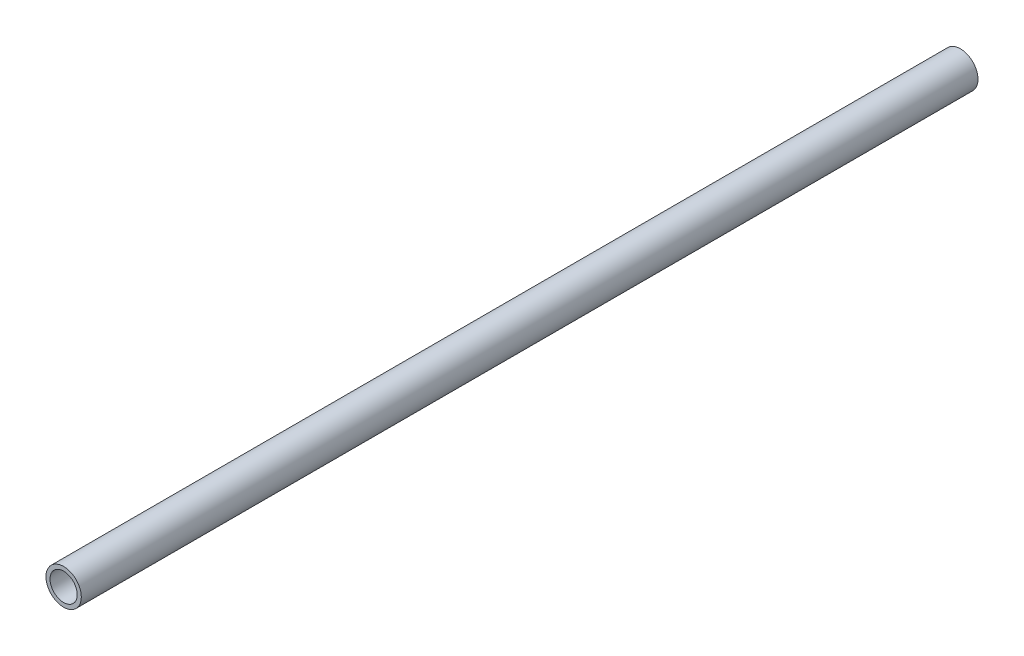
ISO-10303-21;
HEADER;
FILE_DESCRIPTION(('STEP AP214'),'2;1');
FILE_NAME('part.step','',(''),(''),'','','');
FILE_SCHEMA(('AUTOMOTIVE_DESIGN { 1 0 10303 214 1 1 1 1 }'));
ENDSEC;
DATA;
#1=APPLICATION_CONTEXT('core data for automotive mechanical design processes');
#2=APPLICATION_PROTOCOL_DEFINITION('international standard','automotive_design',2000,#1);
#3=PRODUCT_CONTEXT('',#1,'mechanical');
#4=PRODUCT('Part','Part','',(#3));
#5=PRODUCT_RELATED_PRODUCT_CATEGORY('part','',(#4));
#6=PRODUCT_DEFINITION_FORMATION('','',#4);
#7=PRODUCT_DEFINITION_CONTEXT('part definition',#1,'design');
#8=PRODUCT_DEFINITION('design','',#6,#7);
#9=PRODUCT_DEFINITION_SHAPE('','',#8);
#10=(LENGTH_UNIT() NAMED_UNIT(*) SI_UNIT(.MILLI.,.METRE.));
#11=(NAMED_UNIT(*) PLANE_ANGLE_UNIT() SI_UNIT($,.RADIAN.));
#12=(NAMED_UNIT(*) SI_UNIT($,.STERADIAN.) SOLID_ANGLE_UNIT());
#13=UNCERTAINTY_MEASURE_WITH_UNIT(LENGTH_MEASURE(1.E-05),#10,'distance_accuracy_value','');
#14=(GEOMETRIC_REPRESENTATION_CONTEXT(3) GLOBAL_UNCERTAINTY_ASSIGNED_CONTEXT((#13)) GLOBAL_UNIT_ASSIGNED_CONTEXT((#10,
#11,#12)) REPRESENTATION_CONTEXT('',''));
#15=CARTESIAN_POINT('',(0.,0.,0.));
#16=DIRECTION('',(0.,0.,1.));
#17=DIRECTION('',(1.,0.,0.));
#18=AXIS2_PLACEMENT_3D('',#15,#16,#17);
#19=CARTESIAN_POINT('',(0.,0.,165.));
#20=DIRECTION('',(0.,0.,1.));
#21=DIRECTION('',(1.,0.,0.));
#22=AXIS2_PLACEMENT_3D('',#19,#20,#21);
#23=PLANE('',#22);
#24=CARTESIAN_POINT('',(0.,0.,165.));
#25=DIRECTION('',(0.,0.,1.));
#26=DIRECTION('',(1.,0.,0.));
#27=AXIS2_PLACEMENT_3D('',#24,#25,#26);
#28=CIRCLE('',#27,6.5);
#29=CARTESIAN_POINT('',(6.5,0.,165.));
#30=VERTEX_POINT('',#29);
#31=EDGE_CURVE('E10',#30,#30,#28,.T.);
#32=ORIENTED_EDGE('',*,*,#31,.T.);
#33=EDGE_LOOP('',(#32));
#34=FACE_BOUND('',#33,.T.);
#35=CARTESIAN_POINT('',(0.,0.,165.));
#36=DIRECTION('',(0.,0.,1.));
#37=DIRECTION('',(1.,0.,0.));
#38=AXIS2_PLACEMENT_3D('',#35,#36,#37);
#39=CIRCLE('',#38,5.);
#40=CARTESIAN_POINT('',(5.,0.,165.));
#41=VERTEX_POINT('',#40);
#42=EDGE_CURVE('E52',#41,#41,#39,.T.);
#43=ORIENTED_EDGE('',*,*,#42,.F.);
#44=EDGE_LOOP('',(#43));
#45=FACE_BOUND('',#44,.T.);
#46=ADVANCED_FACE('F39',(#34,#45),#23,.T.);
#47=CARTESIAN_POINT('',(0.,0.,-165.));
#48=DIRECTION('',(0.,0.,1.));
#49=DIRECTION('',(1.,0.,0.));
#50=AXIS2_PLACEMENT_3D('',#47,#48,#49);
#51=PLANE('',#50);
#52=CARTESIAN_POINT('',(0.,0.,-165.));
#53=DIRECTION('',(0.,0.,1.));
#54=DIRECTION('',(1.,0.,0.));
#55=AXIS2_PLACEMENT_3D('',#52,#53,#54);
#56=CIRCLE('',#55,6.5);
#57=CARTESIAN_POINT('',(6.5,0.,-165.));
#58=VERTEX_POINT('',#57);
#59=EDGE_CURVE('E43',#58,#58,#56,.T.);
#60=ORIENTED_EDGE('',*,*,#59,.F.);
#61=EDGE_LOOP('',(#60));
#62=FACE_BOUND('',#61,.T.);
#63=CARTESIAN_POINT('',(0.,0.,-165.));
#64=DIRECTION('',(0.,0.,1.));
#65=DIRECTION('',(1.,0.,0.));
#66=AXIS2_PLACEMENT_3D('',#63,#64,#65);
#67=CIRCLE('',#66,5.);
#68=CARTESIAN_POINT('',(5.,0.,-165.));
#69=VERTEX_POINT('',#68);
#70=EDGE_CURVE('E54',#69,#69,#67,.T.);
#71=ORIENTED_EDGE('',*,*,#70,.T.);
#72=EDGE_LOOP('',(#71));
#73=FACE_BOUND('',#72,.T.);
#74=ADVANCED_FACE('F66',(#62,#73),#51,.F.);
#75=CARTESIAN_POINT('',(0.,0.,165.));
#76=DIRECTION('',(0.,0.,-1.));
#77=DIRECTION('',(-1.,0.,0.));
#78=AXIS2_PLACEMENT_3D('',#75,#76,#77);
#79=CYLINDRICAL_SURFACE('',#78,6.5);
#80=ORIENTED_EDGE('',*,*,#31,.F.);
#81=EDGE_LOOP('',(#80));
#82=FACE_BOUND('',#81,.T.);
#83=ORIENTED_EDGE('',*,*,#59,.T.);
#84=EDGE_LOOP('',(#83));
#85=FACE_BOUND('',#84,.T.);
#86=ADVANCED_FACE('F41',(#82,#85),#79,.T.);
#87=CARTESIAN_POINT('',(0.,0.,165.));
#88=DIRECTION('',(0.,0.,-1.));
#89=DIRECTION('',(-1.,0.,0.));
#90=AXIS2_PLACEMENT_3D('',#87,#88,#89);
#91=CYLINDRICAL_SURFACE('',#90,5.);
#92=ORIENTED_EDGE('',*,*,#42,.T.);
#93=EDGE_LOOP('',(#92));
#94=FACE_BOUND('',#93,.T.);
#95=ORIENTED_EDGE('',*,*,#70,.F.);
#96=EDGE_LOOP('',(#95));
#97=FACE_BOUND('',#96,.T.);
#98=ADVANCED_FACE('F62',(#94,#97),#91,.F.);
#99=CLOSED_SHELL('',(#46,#74,#86,#98));
#100=MANIFOLD_SOLID_BREP('B2',#99);
#101=ADVANCED_BREP_SHAPE_REPRESENTATION('',(#18,#100),#14);
#102=SHAPE_DEFINITION_REPRESENTATION(#9,#101);
ENDSEC;
END-ISO-10303-21;
